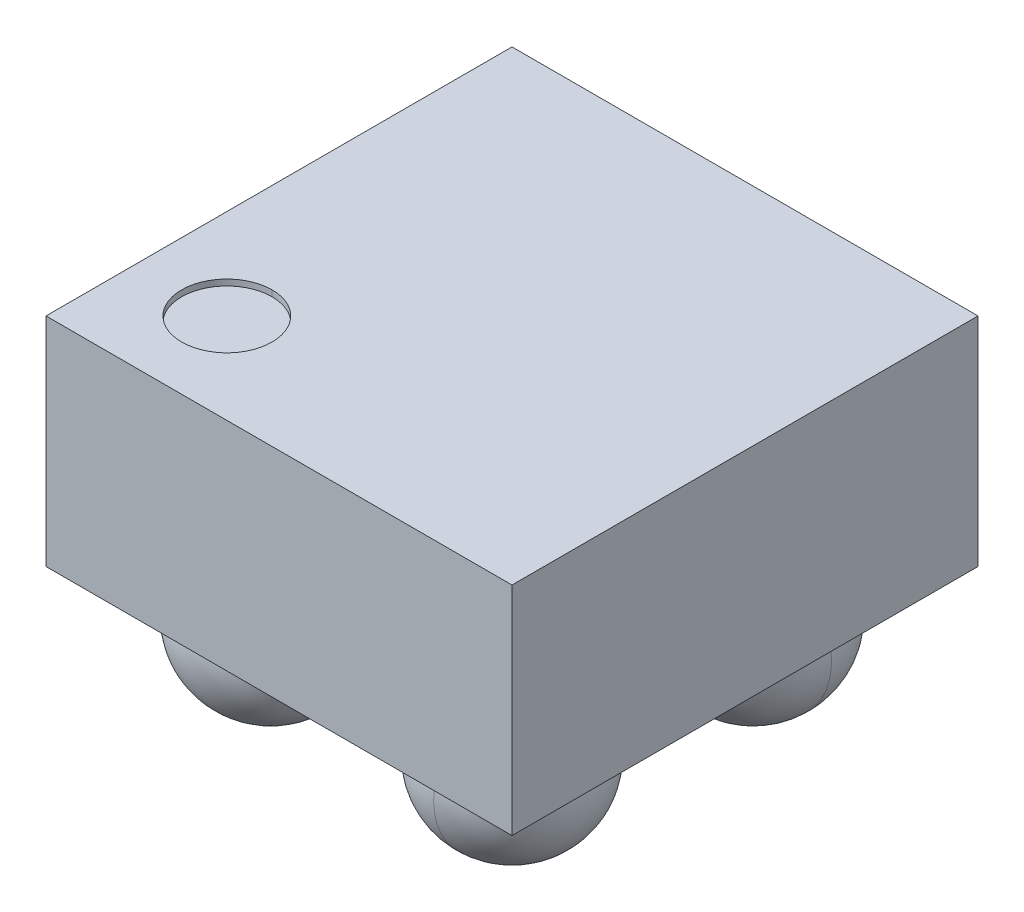
ISO-10303-21;
HEADER;
FILE_DESCRIPTION(('STEP AP214'),'2;1');
FILE_NAME('part.step','',(''),(''),'','','');
FILE_SCHEMA(('AUTOMOTIVE_DESIGN { 1 0 10303 214 1 1 1 1 }'));
ENDSEC;
DATA;
#1=APPLICATION_CONTEXT('core data for automotive mechanical design processes');
#2=APPLICATION_PROTOCOL_DEFINITION('international standard','automotive_design',2000,#1);
#3=PRODUCT_CONTEXT('',#1,'mechanical');
#4=PRODUCT('Part','Part','',(#3));
#5=PRODUCT_RELATED_PRODUCT_CATEGORY('part','',(#4));
#6=PRODUCT_DEFINITION_FORMATION('','',#4);
#7=PRODUCT_DEFINITION_CONTEXT('part definition',#1,'design');
#8=PRODUCT_DEFINITION('design','',#6,#7);
#9=PRODUCT_DEFINITION_SHAPE('','',#8);
#10=(LENGTH_UNIT() NAMED_UNIT(*) SI_UNIT(.MILLI.,.METRE.));
#11=(NAMED_UNIT(*) PLANE_ANGLE_UNIT() SI_UNIT($,.RADIAN.));
#12=(NAMED_UNIT(*) SI_UNIT($,.STERADIAN.) SOLID_ANGLE_UNIT());
#13=UNCERTAINTY_MEASURE_WITH_UNIT(LENGTH_MEASURE(1.E-05),#10,'distance_accuracy_value','');
#14=(GEOMETRIC_REPRESENTATION_CONTEXT(3) GLOBAL_UNCERTAINTY_ASSIGNED_CONTEXT((#13)) GLOBAL_UNIT_ASSIGNED_CONTEXT((#10,
#11,#12)) REPRESENTATION_CONTEXT('',''));
#15=CARTESIAN_POINT('',(0.,0.,0.));
#16=DIRECTION('',(0.,0.,1.));
#17=DIRECTION('',(1.,0.,0.));
#18=AXIS2_PLACEMENT_3D('',#15,#16,#17);
#19=CARTESIAN_POINT('',(-0.2365,0.49,0.2365));
#20=DIRECTION('',(0.,1.,0.));
#21=DIRECTION('',(0.,0.,1.));
#22=AXIS2_PLACEMENT_3D('',#19,#20,#21);
#23=CYLINDRICAL_SURFACE('',#22,0.075);
#24=CARTESIAN_POINT('',(-0.2365,0.49,0.2365));
#25=DIRECTION('',(0.,1.,0.));
#26=DIRECTION('',(0.,0.,1.));
#27=AXIS2_PLACEMENT_3D('',#24,#25,#26);
#28=CIRCLE('',#27,0.075);
#29=CARTESIAN_POINT('',(-0.2365,0.49,0.1615));
#30=VERTEX_POINT('',#29);
#31=CARTESIAN_POINT('',(-0.2365,0.49,0.3115));
#32=VERTEX_POINT('',#31);
#33=EDGE_CURVE('E11',#30,#32,#28,.T.);
#34=ORIENTED_EDGE('',*,*,#33,.F.);
#35=DIRECTION('',(0.,1.,0.));
#36=VECTOR('',#35,1.);
#37=CARTESIAN_POINT('',(-0.2365,0.49,0.1615));
#38=LINE('',#37,#36);
#39=CARTESIAN_POINT('',(-0.2365,0.5,0.1615));
#40=VERTEX_POINT('',#39);
#41=EDGE_CURVE('E24',#30,#40,#38,.T.);
#42=ORIENTED_EDGE('',*,*,#41,.T.);
#43=CARTESIAN_POINT('',(-0.2365,0.5,0.2365));
#44=DIRECTION('',(0.,1.,0.));
#45=DIRECTION('',(0.,0.,1.));
#46=AXIS2_PLACEMENT_3D('',#43,#44,#45);
#47=CIRCLE('',#46,0.075);
#48=CARTESIAN_POINT('',(-0.2365,0.5,0.3115));
#49=VERTEX_POINT('',#48);
#50=EDGE_CURVE('E286',#40,#49,#47,.T.);
#51=ORIENTED_EDGE('',*,*,#50,.T.);
#52=DIRECTION('',(0.,1.,0.));
#53=VECTOR('',#52,1.);
#54=CARTESIAN_POINT('',(-0.2365,0.49,0.3115));
#55=LINE('',#54,#53);
#56=EDGE_CURVE('E37',#32,#49,#55,.T.);
#57=ORIENTED_EDGE('',*,*,#56,.F.);
#58=EDGE_LOOP('',(#34,#42,#51,#57));
#59=FACE_BOUND('',#58,.T.);
#60=ADVANCED_FACE('F17',(#59),#23,.F.);
#61=CARTESIAN_POINT('',(-0.200000000000002,0.07,-0.199999999999998));
#62=DIRECTION('',(1.,0.,0.));
#63=DIRECTION('',(0.,0.,1.));
#64=AXIS2_PLACEMENT_3D('',#61,#62,#63);
#65=SPHERICAL_SURFACE('',#64,0.13);
#66=CARTESIAN_POINT('',(-0.200000000000002,0.07,-0.199999999999998));
#67=DIRECTION('',(-1.,0.,0.));
#68=DIRECTION('',(0.,0.,1.));
#69=AXIS2_PLACEMENT_3D('',#66,#67,#68);
#70=CIRCLE('',#69,0.13);
#71=CARTESIAN_POINT('',(-0.200000000000001,0.0700000000000001,-0.0699999999999979));
#72=VERTEX_POINT('',#71);
#73=CARTESIAN_POINT('',(-0.200000000000001,0.14,-0.0904554884989647));
#74=VERTEX_POINT('',#73);
#75=EDGE_CURVE('E280',#72,#74,#70,.T.);
#76=ORIENTED_EDGE('',*,*,#75,.F.);
#77=CARTESIAN_POINT('',(-0.200000000000001,0.07,-0.0699999999999979));
#78=CARTESIAN_POINT('',(-0.159159295503333,0.0699999999999998,-0.0699999999999981));
#79=CARTESIAN_POINT('',(-0.118280486362824,0.0700000000000003,-0.0859919505259448));
#80=CARTESIAN_POINT('',(-0.0859919505259467,0.0699999999999998,-0.118280486362822));
#81=CARTESIAN_POINT('',(-0.0700000000000017,0.0700000000000001,-0.159159295503332));
#82=CARTESIAN_POINT('',(-0.070000000000002,0.07,-0.199999999999999));
#83=B_SPLINE_CURVE_WITH_KNOTS('',5,(#77,#78,#79,#80,#81,#82),.UNSPECIFIED.,.F.,.F.,(6,6),(0.,
1.5707963267949),.UNSPECIFIED.);
#84=CARTESIAN_POINT('',(-0.070000000000002,0.07,-0.199999999999999));
#85=VERTEX_POINT('',#84);
#86=EDGE_CURVE('E276',#72,#85,#83,.T.);
#87=ORIENTED_EDGE('',*,*,#86,.T.);
#88=ORIENTED_EDGE('',*,*,#86,.F.);
#89=CARTESIAN_POINT('',(-0.200000000000002,-0.06,-0.199999999999998));
#90=VERTEX_POINT('',#89);
#91=EDGE_CURVE('E144',#90,#72,#70,.T.);
#92=ORIENTED_EDGE('',*,*,#91,.F.);
#93=CARTESIAN_POINT('',(-0.200000000000002,0.07,-0.199999999999998));
#94=DIRECTION('',(1.,0.,0.));
#95=DIRECTION('',(0.,0.,-1.));
#96=AXIS2_PLACEMENT_3D('',#93,#94,#95);
#97=CIRCLE('',#96,0.13);
#98=CARTESIAN_POINT('',(-0.200000000000003,0.14,-0.309544511501031));
#99=VERTEX_POINT('',#98);
#100=EDGE_CURVE('E274',#90,#99,#97,.T.);
#101=ORIENTED_EDGE('',*,*,#100,.T.);
#102=CARTESIAN_POINT('',(-0.200000000000002,0.14,-0.199999999999998));
#103=DIRECTION('',(0.,1.,0.));
#104=DIRECTION('',(0.,0.,-1.));
#105=AXIS2_PLACEMENT_3D('',#102,#103,#104);
#106=CIRCLE('',#105,0.109544511501033);
#107=EDGE_CURVE('E271',#74,#99,#106,.T.);
#108=ORIENTED_EDGE('',*,*,#107,.F.);
#109=EDGE_LOOP('',(#76,#87,#88,#92,#101,#108));
#110=FACE_BOUND('',#109,.T.);
#111=ADVANCED_FACE('F324',(#110),#65,.T.);
#112=CARTESIAN_POINT('',(0.2,0.0699999999999999,-0.2));
#113=DIRECTION('',(0.,0.,1.));
#114=DIRECTION('',(-1.,0.,0.));
#115=AXIS2_PLACEMENT_3D('',#112,#113,#114);
#116=SPHERICAL_SURFACE('',#115,0.13);
#117=CARTESIAN_POINT('',(0.2,0.0699999999999999,-0.2));
#118=DIRECTION('',(0.,0.,-1.));
#119=DIRECTION('',(-1.,0.,0.));
#120=AXIS2_PLACEMENT_3D('',#117,#118,#119);
#121=CIRCLE('',#120,0.13);
#122=CARTESIAN_POINT('',(0.07,0.07,-0.2));
#123=VERTEX_POINT('',#122);
#124=CARTESIAN_POINT('',(0.0904554884989669,0.14,-0.2));
#125=VERTEX_POINT('',#124);
#126=EDGE_CURVE('E266',#123,#125,#121,.T.);
#127=ORIENTED_EDGE('',*,*,#126,.F.);
#128=CARTESIAN_POINT('',(0.07,0.07,-0.2));
#129=CARTESIAN_POINT('',(0.0699999999999999,0.0699999999999998,-0.159159295503332));
#130=CARTESIAN_POINT('',(0.085991950525946,0.0700000000000002,-0.118280486362823));
#131=CARTESIAN_POINT('',(0.118280486362823,0.0699999999999998,-0.0859919505259454));
#132=CARTESIAN_POINT('',(0.159159295503333,0.0699999999999999,-0.0700000000000002));
#133=CARTESIAN_POINT('',(0.2,0.0699999999999998,-0.07));
#134=B_SPLINE_CURVE_WITH_KNOTS('',5,(#128,#129,#130,#131,#132,#133),.UNSPECIFIED.,.F.,.F.,(6,6),
(0.,1.5707963267949),.UNSPECIFIED.);
#135=CARTESIAN_POINT('',(0.2,0.0699999999999999,-0.07));
#136=VERTEX_POINT('',#135);
#137=EDGE_CURVE('E262',#123,#136,#134,.T.);
#138=ORIENTED_EDGE('',*,*,#137,.T.);
#139=ORIENTED_EDGE('',*,*,#137,.F.);
#140=CARTESIAN_POINT('',(0.2,-0.0600000000000002,-0.2));
#141=VERTEX_POINT('',#140);
#142=EDGE_CURVE('E261',#141,#123,#121,.T.);
#143=ORIENTED_EDGE('',*,*,#142,.F.);
#144=CARTESIAN_POINT('',(0.2,0.0699999999999999,-0.2));
#145=DIRECTION('',(0.,0.,1.));
#146=DIRECTION('',(1.,0.,0.));
#147=AXIS2_PLACEMENT_3D('',#144,#145,#146);
#148=CIRCLE('',#147,0.13);
#149=CARTESIAN_POINT('',(0.309544511501033,0.14,-0.2));
#150=VERTEX_POINT('',#149);
#151=EDGE_CURVE('E259',#141,#150,#148,.T.);
#152=ORIENTED_EDGE('',*,*,#151,.T.);
#153=CARTESIAN_POINT('',(0.2,0.14,-0.2));
#154=DIRECTION('',(0.,1.,0.));
#155=DIRECTION('',(0.,0.,-1.));
#156=AXIS2_PLACEMENT_3D('',#153,#154,#155);
#157=CIRCLE('',#156,0.109544511501033);
#158=EDGE_CURVE('E256',#125,#150,#157,.T.);
#159=ORIENTED_EDGE('',*,*,#158,.F.);
#160=EDGE_LOOP('',(#127,#138,#139,#143,#152,#159));
#161=FACE_BOUND('',#160,.T.);
#162=ADVANCED_FACE('F328',(#161),#116,.T.);
#163=CARTESIAN_POINT('',(0.200000000000001,0.0699999999999998,0.199999999999999));
#164=DIRECTION('',(-1.,0.,0.));
#165=DIRECTION('',(0.,0.,-1.));
#166=AXIS2_PLACEMENT_3D('',#163,#164,#165);
#167=SPHERICAL_SURFACE('',#166,0.13);
#168=CARTESIAN_POINT('',(0.200000000000001,0.0699999999999998,0.199999999999999));
#169=DIRECTION('',(1.,0.,0.));
#170=DIRECTION('',(0.,0.,-1.));
#171=AXIS2_PLACEMENT_3D('',#168,#169,#170);
#172=CIRCLE('',#171,0.13);
#173=CARTESIAN_POINT('',(0.2,0.0699999999999999,0.0699999999999993));
#174=VERTEX_POINT('',#173);
#175=CARTESIAN_POINT('',(0.2,0.14,0.0904554884989662));
#176=VERTEX_POINT('',#175);
#177=EDGE_CURVE('E251',#174,#176,#172,.T.);
#178=ORIENTED_EDGE('',*,*,#177,.F.);
#179=CARTESIAN_POINT('',(0.2,0.0699999999999999,0.0699999999999993));
#180=CARTESIAN_POINT('',(0.159159295503333,0.0699999999999997,0.0699999999999993));
#181=CARTESIAN_POINT('',(0.118280486362824,0.0700000000000002,0.0859919505259454));
#182=CARTESIAN_POINT('',(0.0859919505259457,0.0699999999999996,0.118280486362823));
#183=CARTESIAN_POINT('',(0.0700000000000007,0.07,0.159159295503333));
#184=CARTESIAN_POINT('',(0.0700000000000007,0.0699999999999999,0.2));
#185=B_SPLINE_CURVE_WITH_KNOTS('',5,(#179,#180,#181,#182,#183,#184),.UNSPECIFIED.,.F.,.F.,(6,6),
(0.,1.5707963267949),.UNSPECIFIED.);
#186=CARTESIAN_POINT('',(0.0700000000000007,0.0699999999999999,0.2));
#187=VERTEX_POINT('',#186);
#188=EDGE_CURVE('E247',#174,#187,#185,.T.);
#189=ORIENTED_EDGE('',*,*,#188,.T.);
#190=ORIENTED_EDGE('',*,*,#188,.F.);
#191=CARTESIAN_POINT('',(0.200000000000001,-0.0600000000000002,0.199999999999999));
#192=VERTEX_POINT('',#191);
#193=EDGE_CURVE('E246',#192,#174,#172,.T.);
#194=ORIENTED_EDGE('',*,*,#193,.F.);
#195=CARTESIAN_POINT('',(0.200000000000001,0.0699999999999998,0.199999999999999));
#196=DIRECTION('',(-1.,0.,0.));
#197=DIRECTION('',(0.,0.,1.));
#198=AXIS2_PLACEMENT_3D('',#195,#196,#197);
#199=CIRCLE('',#198,0.13);
#200=CARTESIAN_POINT('',(0.200000000000001,0.14,0.309544511501032));
#201=VERTEX_POINT('',#200);
#202=EDGE_CURVE('E244',#192,#201,#199,.T.);
#203=ORIENTED_EDGE('',*,*,#202,.T.);
#204=CARTESIAN_POINT('',(0.200000000000001,0.14,0.199999999999999));
#205=DIRECTION('',(0.,1.,0.));
#206=DIRECTION('',(0.,0.,-1.));
#207=AXIS2_PLACEMENT_3D('',#204,#205,#206);
#208=CIRCLE('',#207,0.109544511501033);
#209=EDGE_CURVE('E241',#176,#201,#208,.T.);
#210=ORIENTED_EDGE('',*,*,#209,.F.);
#211=EDGE_LOOP('',(#178,#189,#190,#194,#203,#210));
#212=FACE_BOUND('',#211,.T.);
#213=ADVANCED_FACE('F320',(#212),#167,.T.);
#214=CARTESIAN_POINT('',(-0.2,0.07,0.2));
#215=DIRECTION('',(0.,0.,-1.));
#216=DIRECTION('',(1.,0.,0.));
#217=AXIS2_PLACEMENT_3D('',#214,#215,#216);
#218=SPHERICAL_SURFACE('',#217,0.13);
#219=CARTESIAN_POINT('',(-0.2,0.07,0.2));
#220=DIRECTION('',(0.,0.,1.));
#221=DIRECTION('',(1.,0.,0.));
#222=AXIS2_PLACEMENT_3D('',#219,#220,#221);
#223=CIRCLE('',#222,0.13);
#224=CARTESIAN_POINT('',(-0.07,0.07,0.2));
#225=VERTEX_POINT('',#224);
#226=CARTESIAN_POINT('',(-0.0904554884989668,0.14,0.2));
#227=VERTEX_POINT('',#226);
#228=EDGE_CURVE('E236',#225,#227,#223,.T.);
#229=ORIENTED_EDGE('',*,*,#228,.F.);
#230=CARTESIAN_POINT('',(-0.07,0.07,0.2));
#231=CARTESIAN_POINT('',(-0.0699999999999997,0.0699999999999997,0.159159295503332));
#232=CARTESIAN_POINT('',(-0.0859919505259462,0.0700000000000004,0.118280486362823));
#233=CARTESIAN_POINT('',(-0.118280486362823,0.0699999999999997,0.0859919505259454));
#234=CARTESIAN_POINT('',(-0.159159295503333,0.0700000000000001,0.0700000000000002));
#235=CARTESIAN_POINT('',(-0.2,0.07,0.07));
#236=B_SPLINE_CURVE_WITH_KNOTS('',5,(#230,#231,#232,#233,#234,#235),.UNSPECIFIED.,.F.,.F.,(6,6),
(0.,1.5707963267949),.UNSPECIFIED.);
#237=CARTESIAN_POINT('',(-0.2,0.07,0.07));
#238=VERTEX_POINT('',#237);
#239=EDGE_CURVE('E232',#225,#238,#236,.T.);
#240=ORIENTED_EDGE('',*,*,#239,.T.);
#241=ORIENTED_EDGE('',*,*,#239,.F.);
#242=CARTESIAN_POINT('',(-0.2,-0.06,0.2));
#243=VERTEX_POINT('',#242);
#244=EDGE_CURVE('E231',#243,#225,#223,.T.);
#245=ORIENTED_EDGE('',*,*,#244,.F.);
#246=CARTESIAN_POINT('',(-0.2,0.07,0.2));
#247=DIRECTION('',(0.,0.,-1.));
#248=DIRECTION('',(-1.,0.,0.));
#249=AXIS2_PLACEMENT_3D('',#246,#247,#248);
#250=CIRCLE('',#249,0.13);
#251=CARTESIAN_POINT('',(-0.309544511501033,0.14,0.2));
#252=VERTEX_POINT('',#251);
#253=EDGE_CURVE('E229',#243,#252,#250,.T.);
#254=ORIENTED_EDGE('',*,*,#253,.T.);
#255=CARTESIAN_POINT('',(-0.2,0.14,0.2));
#256=DIRECTION('',(0.,1.,0.));
#257=DIRECTION('',(0.,0.,-1.));
#258=AXIS2_PLACEMENT_3D('',#255,#256,#257);
#259=CIRCLE('',#258,0.109544511501033);
#260=EDGE_CURVE('E226',#227,#252,#259,.T.);
#261=ORIENTED_EDGE('',*,*,#260,.F.);
#262=EDGE_LOOP('',(#229,#240,#241,#245,#254,#261));
#263=FACE_BOUND('',#262,.T.);
#264=ADVANCED_FACE('F312',(#263),#218,.T.);
#265=CARTESIAN_POINT('',(0.3865,0.5,0.3865));
#266=DIRECTION('',(-1.,0.,0.));
#267=DIRECTION('',(0.,0.,1.));
#268=AXIS2_PLACEMENT_3D('',#265,#266,#267);
#269=PLANE('',#268);
#270=DIRECTION('',(0.,0.,-1.));
#271=VECTOR('',#270,1.);
#272=CARTESIAN_POINT('',(0.3865,0.14,0.3865));
#273=LINE('',#272,#271);
#274=CARTESIAN_POINT('',(0.3865,0.14,0.3865));
#275=VERTEX_POINT('',#274);
#276=CARTESIAN_POINT('',(0.3865,0.14,-0.3865));
#277=VERTEX_POINT('',#276);
#278=EDGE_CURVE('E224',#275,#277,#273,.T.);
#279=ORIENTED_EDGE('',*,*,#278,.T.);
#280=DIRECTION('',(0.,-1.,0.));
#281=VECTOR('',#280,1.);
#282=CARTESIAN_POINT('',(0.3865,0.5,-0.3865));
#283=LINE('',#282,#281);
#284=CARTESIAN_POINT('',(0.3865,0.5,-0.3865));
#285=VERTEX_POINT('',#284);
#286=EDGE_CURVE('E221',#285,#277,#283,.T.);
#287=ORIENTED_EDGE('',*,*,#286,.F.);
#288=DIRECTION('',(0.,0.,-1.));
#289=VECTOR('',#288,1.);
#290=CARTESIAN_POINT('',(0.3865,0.5,0.3865));
#291=LINE('',#290,#289);
#292=CARTESIAN_POINT('',(0.3865,0.5,0.3865));
#293=VERTEX_POINT('',#292);
#294=EDGE_CURVE('E218',#293,#285,#291,.T.);
#295=ORIENTED_EDGE('',*,*,#294,.F.);
#296=DIRECTION('',(0.,-1.,0.));
#297=VECTOR('',#296,1.);
#298=CARTESIAN_POINT('',(0.3865,0.5,0.3865));
#299=LINE('',#298,#297);
#300=EDGE_CURVE('E215',#293,#275,#299,.T.);
#301=ORIENTED_EDGE('',*,*,#300,.T.);
#302=EDGE_LOOP('',(#279,#287,#295,#301));
#303=FACE_BOUND('',#302,.T.);
#304=ADVANCED_FACE('F310',(#303),#269,.F.);
#305=CARTESIAN_POINT('',(-0.3865,0.5,-0.3865));
#306=DIRECTION('',(0.,0.,1.));
#307=DIRECTION('',(1.,0.,0.));
#308=AXIS2_PLACEMENT_3D('',#305,#306,#307);
#309=PLANE('',#308);
#310=DIRECTION('',(-1.,0.,0.));
#311=VECTOR('',#310,1.);
#312=CARTESIAN_POINT('',(-0.3865,0.14,-0.3865));
#313=LINE('',#312,#311);
#314=CARTESIAN_POINT('',(-0.3865,0.14,-0.3865));
#315=VERTEX_POINT('',#314);
#316=EDGE_CURVE('E213',#277,#315,#313,.T.);
#317=ORIENTED_EDGE('',*,*,#316,.T.);
#318=DIRECTION('',(0.,-1.,0.));
#319=VECTOR('',#318,1.);
#320=CARTESIAN_POINT('',(-0.3865,0.5,-0.3865));
#321=LINE('',#320,#319);
#322=CARTESIAN_POINT('',(-0.3865,0.5,-0.3865));
#323=VERTEX_POINT('',#322);
#324=EDGE_CURVE('E210',#323,#315,#321,.T.);
#325=ORIENTED_EDGE('',*,*,#324,.F.);
#326=DIRECTION('',(-1.,0.,0.));
#327=VECTOR('',#326,1.);
#328=CARTESIAN_POINT('',(-0.3865,0.5,-0.3865));
#329=LINE('',#328,#327);
#330=EDGE_CURVE('E207',#285,#323,#329,.T.);
#331=ORIENTED_EDGE('',*,*,#330,.F.);
#332=ORIENTED_EDGE('',*,*,#286,.T.);
#333=EDGE_LOOP('',(#317,#325,#331,#332));
#334=FACE_BOUND('',#333,.T.);
#335=ADVANCED_FACE('F302',(#334),#309,.F.);
#336=CARTESIAN_POINT('',(-0.3865,0.5,0.3865));
#337=DIRECTION('',(1.,0.,0.));
#338=DIRECTION('',(0.,0.,-1.));
#339=AXIS2_PLACEMENT_3D('',#336,#337,#338);
#340=PLANE('',#339);
#341=DIRECTION('',(0.,0.,1.));
#342=VECTOR('',#341,1.);
#343=CARTESIAN_POINT('',(-0.3865,0.14,0.3865));
#344=LINE('',#343,#342);
#345=CARTESIAN_POINT('',(-0.3865,0.14,0.3865));
#346=VERTEX_POINT('',#345);
#347=EDGE_CURVE('E205',#315,#346,#344,.T.);
#348=ORIENTED_EDGE('',*,*,#347,.T.);
#349=DIRECTION('',(0.,-1.,0.));
#350=VECTOR('',#349,1.);
#351=CARTESIAN_POINT('',(-0.3865,0.5,0.3865));
#352=LINE('',#351,#350);
#353=CARTESIAN_POINT('',(-0.3865,0.5,0.3865));
#354=VERTEX_POINT('',#353);
#355=EDGE_CURVE('E202',#354,#346,#352,.T.);
#356=ORIENTED_EDGE('',*,*,#355,.F.);
#357=DIRECTION('',(0.,0.,1.));
#358=VECTOR('',#357,1.);
#359=CARTESIAN_POINT('',(-0.3865,0.5,0.3865));
#360=LINE('',#359,#358);
#361=EDGE_CURVE('E199',#323,#354,#360,.T.);
#362=ORIENTED_EDGE('',*,*,#361,.F.);
#363=ORIENTED_EDGE('',*,*,#324,.T.);
#364=EDGE_LOOP('',(#348,#356,#362,#363));
#365=FACE_BOUND('',#364,.T.);
#366=ADVANCED_FACE('F306',(#365),#340,.F.);
#367=CARTESIAN_POINT('',(-0.3865,0.5,0.3865));
#368=DIRECTION('',(0.,0.,-1.));
#369=DIRECTION('',(-1.,0.,0.));
#370=AXIS2_PLACEMENT_3D('',#367,#368,#369);
#371=PLANE('',#370);
#372=DIRECTION('',(1.,0.,0.));
#373=VECTOR('',#372,1.);
#374=CARTESIAN_POINT('',(-0.3865,0.14,0.3865));
#375=LINE('',#374,#373);
#376=EDGE_CURVE('E196',#346,#275,#375,.T.);
#377=ORIENTED_EDGE('',*,*,#376,.T.);
#378=ORIENTED_EDGE('',*,*,#300,.F.);
#379=DIRECTION('',(1.,0.,0.));
#380=VECTOR('',#379,1.);
#381=CARTESIAN_POINT('',(-0.3865,0.5,0.3865));
#382=LINE('',#381,#380);
#383=EDGE_CURVE('E193',#354,#293,#382,.T.);
#384=ORIENTED_EDGE('',*,*,#383,.F.);
#385=ORIENTED_EDGE('',*,*,#355,.T.);
#386=EDGE_LOOP('',(#377,#378,#384,#385));
#387=FACE_BOUND('',#386,.T.);
#388=ADVANCED_FACE('F294',(#387),#371,.F.);
#389=CARTESIAN_POINT('',(0.,0.5,0.));
#390=DIRECTION('',(0.,-1.,0.));
#391=DIRECTION('',(0.,0.,-1.));
#392=AXIS2_PLACEMENT_3D('',#389,#390,#391);
#393=PLANE('',#392);
#394=CARTESIAN_POINT('',(-0.2365,0.5,0.2365));
#395=DIRECTION('',(0.,1.,0.));
#396=DIRECTION('',(0.,0.,1.));
#397=AXIS2_PLACEMENT_3D('',#394,#395,#396);
#398=CIRCLE('',#397,0.075);
#399=EDGE_CURVE('E191',#49,#40,#398,.T.);
#400=ORIENTED_EDGE('',*,*,#399,.F.);
#401=ORIENTED_EDGE('',*,*,#50,.F.);
#402=EDGE_LOOP('',(#400,#401));
#403=FACE_BOUND('',#402,.T.);
#404=ORIENTED_EDGE('',*,*,#294,.T.);
#405=ORIENTED_EDGE('',*,*,#330,.T.);
#406=ORIENTED_EDGE('',*,*,#361,.T.);
#407=ORIENTED_EDGE('',*,*,#383,.T.);
#408=EDGE_LOOP('',(#404,#405,#406,#407));
#409=FACE_BOUND('',#408,.T.);
#410=ADVANCED_FACE('F290',(#403,#409),#393,.F.);
#411=CARTESIAN_POINT('',(0.,0.14,0.));
#412=DIRECTION('',(0.,-1.,0.));
#413=DIRECTION('',(0.,0.,-1.));
#414=AXIS2_PLACEMENT_3D('',#411,#412,#413);
#415=PLANE('',#414);
#416=ORIENTED_EDGE('',*,*,#107,.T.);
#417=CARTESIAN_POINT('',(-0.200000000000002,0.14,-0.199999999999998));
#418=DIRECTION('',(0.,1.,0.));
#419=DIRECTION('',(0.,0.,-1.));
#420=AXIS2_PLACEMENT_3D('',#417,#418,#419);
#421=CIRCLE('',#420,0.109544511501033);
#422=EDGE_CURVE('E188',#99,#74,#421,.T.);
#423=ORIENTED_EDGE('',*,*,#422,.T.);
#424=EDGE_LOOP('',(#416,#423));
#425=FACE_BOUND('',#424,.T.);
#426=ORIENTED_EDGE('',*,*,#158,.T.);
#427=CARTESIAN_POINT('',(0.2,0.14,-0.2));
#428=DIRECTION('',(0.,1.,0.));
#429=DIRECTION('',(0.,0.,-1.));
#430=AXIS2_PLACEMENT_3D('',#427,#428,#429);
#431=CIRCLE('',#430,0.109544511501033);
#432=EDGE_CURVE('E185',#150,#125,#431,.T.);
#433=ORIENTED_EDGE('',*,*,#432,.T.);
#434=EDGE_LOOP('',(#426,#433));
#435=FACE_BOUND('',#434,.T.);
#436=ORIENTED_EDGE('',*,*,#209,.T.);
#437=CARTESIAN_POINT('',(0.200000000000001,0.14,0.199999999999999));
#438=DIRECTION('',(0.,1.,0.));
#439=DIRECTION('',(0.,0.,-1.));
#440=AXIS2_PLACEMENT_3D('',#437,#438,#439);
#441=CIRCLE('',#440,0.109544511501033);
#442=EDGE_CURVE('E182',#201,#176,#441,.T.);
#443=ORIENTED_EDGE('',*,*,#442,.T.);
#444=EDGE_LOOP('',(#436,#443));
#445=FACE_BOUND('',#444,.T.);
#446=ORIENTED_EDGE('',*,*,#260,.T.);
#447=CARTESIAN_POINT('',(-0.2,0.14,0.2));
#448=DIRECTION('',(0.,1.,0.));
#449=DIRECTION('',(0.,0.,-1.));
#450=AXIS2_PLACEMENT_3D('',#447,#448,#449);
#451=CIRCLE('',#450,0.109544511501033);
#452=EDGE_CURVE('E176',#252,#227,#451,.T.);
#453=ORIENTED_EDGE('',*,*,#452,.T.);
#454=EDGE_LOOP('',(#446,#453));
#455=FACE_BOUND('',#454,.T.);
#456=ORIENTED_EDGE('',*,*,#278,.F.);
#457=ORIENTED_EDGE('',*,*,#376,.F.);
#458=ORIENTED_EDGE('',*,*,#347,.F.);
#459=ORIENTED_EDGE('',*,*,#316,.F.);
#460=EDGE_LOOP('',(#456,#457,#458,#459));
#461=FACE_BOUND('',#460,.T.);
#462=ADVANCED_FACE('F293',(#425,#435,#445,#455,#461),#415,.T.);
#463=CARTESIAN_POINT('',(-0.2,0.07,0.2));
#464=DIRECTION('',(0.,0.,-1.));
#465=DIRECTION('',(1.,0.,0.));
#466=AXIS2_PLACEMENT_3D('',#463,#464,#465);
#467=SPHERICAL_SURFACE('',#466,0.13);
#468=ORIENTED_EDGE('',*,*,#253,.F.);
#469=ORIENTED_EDGE('',*,*,#244,.T.);
#470=CARTESIAN_POINT('',(-0.2,0.07,0.33));
#471=CARTESIAN_POINT('',(-0.159159295503333,0.0700000000000002,0.330000000000001));
#472=CARTESIAN_POINT('',(-0.118280486362822,0.0699999999999997,0.314008049474053));
#473=CARTESIAN_POINT('',(-0.0859919505259461,0.0700000000000002,0.281719513637178));
#474=CARTESIAN_POINT('',(-0.0699999999999999,0.07,0.240840704496667));
#475=CARTESIAN_POINT('',(-0.07,0.07,0.2));
#476=B_SPLINE_CURVE_WITH_KNOTS('',5,(#470,#471,#472,#473,#474,#475),.UNSPECIFIED.,.F.,.F.,(6,6),
(-1.5707963267949,0.),.UNSPECIFIED.);
#477=CARTESIAN_POINT('',(-0.2,0.07,0.33));
#478=VERTEX_POINT('',#477);
#479=EDGE_CURVE('E168',#478,#225,#476,.T.);
#480=ORIENTED_EDGE('',*,*,#479,.F.);
#481=ORIENTED_EDGE('',*,*,#479,.T.);
#482=ORIENTED_EDGE('',*,*,#228,.T.);
#483=ORIENTED_EDGE('',*,*,#452,.F.);
#484=EDGE_LOOP('',(#468,#469,#480,#481,#482,#483));
#485=FACE_BOUND('',#484,.T.);
#486=ADVANCED_FACE('F350',(#485),#467,.T.);
#487=CARTESIAN_POINT('',(0.200000000000001,0.0699999999999998,0.199999999999999));
#488=DIRECTION('',(-1.,0.,0.));
#489=DIRECTION('',(0.,0.,-1.));
#490=AXIS2_PLACEMENT_3D('',#487,#488,#489);
#491=SPHERICAL_SURFACE('',#490,0.13);
#492=ORIENTED_EDGE('',*,*,#202,.F.);
#493=ORIENTED_EDGE('',*,*,#193,.T.);
#494=CARTESIAN_POINT('',(0.330000000000001,0.0699999999999998,0.199999999999999));
#495=CARTESIAN_POINT('',(0.330000000000001,0.0699999999999999,0.159159295503332));
#496=CARTESIAN_POINT('',(0.314008049474053,0.0699999999999997,0.118280486362822));
#497=CARTESIAN_POINT('',(0.281719513637179,0.07,0.0859919505259449));
#498=CARTESIAN_POINT('',(0.240840704496667,0.0699999999999999,0.0699999999999991));
#499=CARTESIAN_POINT('',(0.2,0.0699999999999999,0.0699999999999993));
#500=B_SPLINE_CURVE_WITH_KNOTS('',5,(#494,#495,#496,#497,#498,#499),.UNSPECIFIED.,.F.,.F.,(6,6),
(-1.5707963267949,0.),.UNSPECIFIED.);
#501=CARTESIAN_POINT('',(0.330000000000001,0.0699999999999998,0.199999999999999));
#502=VERTEX_POINT('',#501);
#503=EDGE_CURVE('E149',#502,#174,#500,.T.);
#504=ORIENTED_EDGE('',*,*,#503,.F.);
#505=ORIENTED_EDGE('',*,*,#503,.T.);
#506=ORIENTED_EDGE('',*,*,#177,.T.);
#507=ORIENTED_EDGE('',*,*,#442,.F.);
#508=EDGE_LOOP('',(#492,#493,#504,#505,#506,#507));
#509=FACE_BOUND('',#508,.T.);
#510=ADVANCED_FACE('F346',(#509),#491,.T.);
#511=CARTESIAN_POINT('',(0.2,0.0699999999999999,-0.2));
#512=DIRECTION('',(0.,0.,1.));
#513=DIRECTION('',(-1.,0.,0.));
#514=AXIS2_PLACEMENT_3D('',#511,#512,#513);
#515=SPHERICAL_SURFACE('',#514,0.13);
#516=ORIENTED_EDGE('',*,*,#151,.F.);
#517=ORIENTED_EDGE('',*,*,#142,.T.);
#518=CARTESIAN_POINT('',(0.2,0.0699999999999999,-0.33));
#519=CARTESIAN_POINT('',(0.159159295503333,0.07,-0.330000000000001));
#520=CARTESIAN_POINT('',(0.118280486362822,0.0699999999999997,-0.314008049474053));
#521=CARTESIAN_POINT('',(0.0859919505259462,0.0700000000000001,-0.281719513637178));
#522=CARTESIAN_POINT('',(0.0699999999999998,0.07,-0.240840704496667));
#523=CARTESIAN_POINT('',(0.07,0.07,-0.2));
#524=B_SPLINE_CURVE_WITH_KNOTS('',5,(#518,#519,#520,#521,#522,#523),.UNSPECIFIED.,.F.,.F.,(6,6),
(-1.5707963267949,0.),.UNSPECIFIED.);
#525=CARTESIAN_POINT('',(0.2,0.0699999999999999,-0.33));
#526=VERTEX_POINT('',#525);
#527=EDGE_CURVE('E145',#526,#123,#524,.T.);
#528=ORIENTED_EDGE('',*,*,#527,.F.);
#529=ORIENTED_EDGE('',*,*,#527,.T.);
#530=ORIENTED_EDGE('',*,*,#126,.T.);
#531=ORIENTED_EDGE('',*,*,#432,.F.);
#532=EDGE_LOOP('',(#516,#517,#528,#529,#530,#531));
#533=FACE_BOUND('',#532,.T.);
#534=ADVANCED_FACE('F364',(#533),#515,.T.);
#535=CARTESIAN_POINT('',(-0.200000000000002,0.07,-0.199999999999998));
#536=DIRECTION('',(1.,0.,0.));
#537=DIRECTION('',(0.,0.,1.));
#538=AXIS2_PLACEMENT_3D('',#535,#536,#537);
#539=SPHERICAL_SURFACE('',#538,0.13);
#540=ORIENTED_EDGE('',*,*,#100,.F.);
#541=ORIENTED_EDGE('',*,*,#91,.T.);
#542=CARTESIAN_POINT('',(-0.330000000000002,0.07,-0.199999999999997));
#543=CARTESIAN_POINT('',(-0.330000000000002,0.0700000000000002,-0.15915929550333));
#544=CARTESIAN_POINT('',(-0.314008049474054,0.0699999999999999,-0.118280486362819));
#545=CARTESIAN_POINT('',(-0.281719513637179,0.0700000000000003,-0.0859919505259431));
#546=CARTESIAN_POINT('',(-0.240840704496668,0.07,-0.0699999999999974));
#547=CARTESIAN_POINT('',(-0.200000000000001,0.0700000000000001,-0.0699999999999979));
#548=B_SPLINE_CURVE_WITH_KNOTS('',5,(#542,#543,#544,#545,#546,#547),.UNSPECIFIED.,.F.,.F.,(6,6),
(-1.5707963267949,0.),.UNSPECIFIED.);
#549=CARTESIAN_POINT('',(-0.330000000000002,0.07,-0.199999999999997));
#550=VERTEX_POINT('',#549);
#551=EDGE_CURVE('E141',#550,#72,#548,.T.);
#552=ORIENTED_EDGE('',*,*,#551,.F.);
#553=ORIENTED_EDGE('',*,*,#551,.T.);
#554=ORIENTED_EDGE('',*,*,#75,.T.);
#555=ORIENTED_EDGE('',*,*,#422,.F.);
#556=EDGE_LOOP('',(#540,#541,#552,#553,#554,#555));
#557=FACE_BOUND('',#556,.T.);
#558=ADVANCED_FACE('F143',(#557),#539,.T.);
#559=CARTESIAN_POINT('',(-0.2365,0.49,0.2365));
#560=DIRECTION('',(0.,1.,0.));
#561=DIRECTION('',(0.,0.,1.));
#562=AXIS2_PLACEMENT_3D('',#559,#560,#561);
#563=CYLINDRICAL_SURFACE('',#562,0.075);
#564=ORIENTED_EDGE('',*,*,#41,.F.);
#565=CARTESIAN_POINT('',(-0.2365,0.49,0.2365));
#566=DIRECTION('',(0.,1.,0.));
#567=DIRECTION('',(0.,0.,1.));
#568=AXIS2_PLACEMENT_3D('',#565,#566,#567);
#569=CIRCLE('',#568,0.075);
#570=EDGE_CURVE('E146',#32,#30,#569,.T.);
#571=ORIENTED_EDGE('',*,*,#570,.F.);
#572=ORIENTED_EDGE('',*,*,#56,.T.);
#573=ORIENTED_EDGE('',*,*,#399,.T.);
#574=EDGE_LOOP('',(#564,#571,#572,#573));
#575=FACE_BOUND('',#574,.T.);
#576=ADVANCED_FACE('F288',(#575),#563,.F.);
#577=CARTESIAN_POINT('',(-0.2365,0.49,0.2365));
#578=DIRECTION('',(0.,1.,0.));
#579=DIRECTION('',(0.,0.,1.));
#580=AXIS2_PLACEMENT_3D('',#577,#578,#579);
#581=PLANE('',#580);
#582=ORIENTED_EDGE('',*,*,#570,.T.);
#583=ORIENTED_EDGE('',*,*,#33,.T.);
#584=EDGE_LOOP('',(#582,#583));
#585=FACE_BOUND('',#584,.T.);
#586=ADVANCED_FACE('F439',(#585),#581,.T.);
#587=CLOSED_SHELL('',(#60,#111,#162,#213,#264,#304,#335,#366,#388,#410,#462,#486,#510,#534,#558,
#576,#586));
#588=MANIFOLD_SOLID_BREP('B1',#587);
#589=ADVANCED_BREP_SHAPE_REPRESENTATION('',(#18,#588),#14);
#590=SHAPE_DEFINITION_REPRESENTATION(#9,#589);
ENDSEC;
END-ISO-10303-21;
